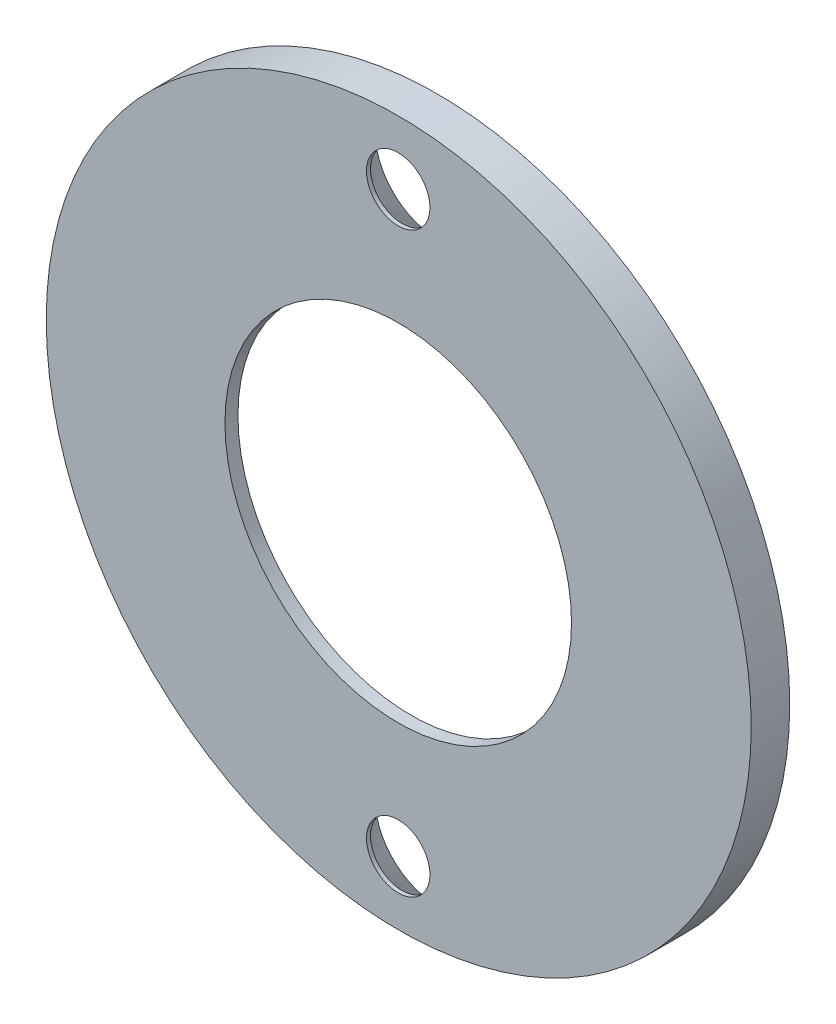
ISO-10303-21;
HEADER;
FILE_DESCRIPTION(('STEP AP214'),'2;1');
FILE_NAME('part.step','',(''),(''),'','','');
FILE_SCHEMA(('AUTOMOTIVE_DESIGN { 1 0 10303 214 1 1 1 1 }'));
ENDSEC;
DATA;
#1=APPLICATION_CONTEXT('core data for automotive mechanical design processes');
#2=APPLICATION_PROTOCOL_DEFINITION('international standard','automotive_design',2000,#1);
#3=PRODUCT_CONTEXT('',#1,'mechanical');
#4=PRODUCT('Part','Part','',(#3));
#5=PRODUCT_RELATED_PRODUCT_CATEGORY('part','',(#4));
#6=PRODUCT_DEFINITION_FORMATION('','',#4);
#7=PRODUCT_DEFINITION_CONTEXT('part definition',#1,'design');
#8=PRODUCT_DEFINITION('design','',#6,#7);
#9=PRODUCT_DEFINITION_SHAPE('','',#8);
#10=(LENGTH_UNIT() NAMED_UNIT(*) SI_UNIT(.MILLI.,.METRE.));
#11=(NAMED_UNIT(*) PLANE_ANGLE_UNIT() SI_UNIT($,.RADIAN.));
#12=(NAMED_UNIT(*) SI_UNIT($,.STERADIAN.) SOLID_ANGLE_UNIT());
#13=UNCERTAINTY_MEASURE_WITH_UNIT(LENGTH_MEASURE(1.E-05),#10,'distance_accuracy_value','');
#14=(GEOMETRIC_REPRESENTATION_CONTEXT(3) GLOBAL_UNCERTAINTY_ASSIGNED_CONTEXT((#13)) GLOBAL_UNIT_ASSIGNED_CONTEXT((#10,
#11,#12)) REPRESENTATION_CONTEXT('',''));
#15=CARTESIAN_POINT('',(0.,0.,0.));
#16=DIRECTION('',(0.,0.,1.));
#17=DIRECTION('',(1.,0.,0.));
#18=AXIS2_PLACEMENT_3D('',#15,#16,#17);
#19=CARTESIAN_POINT('',(0.,0.,-2.35438842952955));
#20=DIRECTION('',(0.,0.,-1.));
#21=DIRECTION('',(-1.,0.,0.));
#22=AXIS2_PLACEMENT_3D('',#19,#20,#21);
#23=PLANE('',#22);
#24=CARTESIAN_POINT('',(-0.0235782982945206,12.953978541894,-2.35438842952955));
#25=DIRECTION('',(0.,0.,-1.));
#26=DIRECTION('',(1.,0.,0.));
#27=AXIS2_PLACEMENT_3D('',#24,#25,#26);
#28=CIRCLE('',#27,1.4224);
#29=CARTESIAN_POINT('',(-1.44597829829452,12.953978541894,-2.35438842952955));
#30=VERTEX_POINT('',#29);
#31=EDGE_CURVE('E124',#30,#30,#28,.T.);
#32=ORIENTED_EDGE('',*,*,#31,.T.);
#33=EDGE_LOOP('',(#32));
#34=FACE_BOUND('',#33,.T.);
#35=CARTESIAN_POINT('',(-0.0235782982945324,-12.953978541894,-2.35438842952955));
#36=DIRECTION('',(0.,0.,-1.));
#37=DIRECTION('',(1.,0.,0.));
#38=AXIS2_PLACEMENT_3D('',#35,#36,#37);
#39=CIRCLE('',#38,1.4224);
#40=CARTESIAN_POINT('',(-1.44597829829453,-12.953978541894,-2.35438842952955));
#41=VERTEX_POINT('',#40);
#42=EDGE_CURVE('E116',#41,#41,#39,.T.);
#43=ORIENTED_EDGE('',*,*,#42,.T.);
#44=EDGE_LOOP('',(#43));
#45=FACE_BOUND('',#44,.T.);
#46=CARTESIAN_POINT('',(-0.0237208953445327,0.,-2.35438842952955));
#47=DIRECTION('',(0.,0.,-1.));
#48=DIRECTION('',(1.,0.,0.));
#49=AXIS2_PLACEMENT_3D('',#46,#47,#48);
#50=CIRCLE('',#49,7.7724);
#51=CARTESIAN_POINT('',(-7.79612089534453,0.,-2.35438842952955));
#52=VERTEX_POINT('',#51);
#53=EDGE_CURVE('E117',#52,#52,#50,.T.);
#54=ORIENTED_EDGE('',*,*,#53,.T.);
#55=EDGE_LOOP('',(#54));
#56=FACE_BOUND('',#55,.T.);
#57=CARTESIAN_POINT('',(0.,0.,-2.35438842952955));
#58=DIRECTION('',(0.,0.,1.));
#59=DIRECTION('',(1.,0.,0.));
#60=AXIS2_PLACEMENT_3D('',#57,#58,#59);
#61=CIRCLE('',#60,15.8098189243227);
#62=CARTESIAN_POINT('',(-15.8098189243227,0.,-2.35438842952955));
#63=VERTEX_POINT('',#62);
#64=EDGE_CURVE('E21',#63,#63,#61,.T.);
#65=ORIENTED_EDGE('',*,*,#64,.T.);
#66=EDGE_LOOP('',(#65));
#67=FACE_BOUND('',#66,.T.);
#68=ADVANCED_FACE('F17',(#34,#45,#56,#67),#23,.F.);
#69=CARTESIAN_POINT('',(0.,0.,-4.08158842952954));
#70=DIRECTION('',(0.,0.,1.));
#71=DIRECTION('',(1.,0.,0.));
#72=AXIS2_PLACEMENT_3D('',#69,#70,#71);
#73=CYLINDRICAL_SURFACE('',#72,15.8098189243227);
#74=ORIENTED_EDGE('',*,*,#64,.F.);
#75=DIRECTION('',(0.,0.,-1.));
#76=VECTOR('',#75,1.);
#77=CARTESIAN_POINT('',(-15.8098189243227,0.,-4.08158842952954));
#78=LINE('',#77,#76);
#79=CARTESIAN_POINT('',(-15.8098189243227,0.,-4.08158842952954));
#80=VERTEX_POINT('',#79);
#81=EDGE_CURVE('E11',#63,#80,#78,.T.);
#82=ORIENTED_EDGE('',*,*,#81,.T.);
#83=CARTESIAN_POINT('',(0.,0.,-4.08158842952954));
#84=DIRECTION('',(0.,0.,-1.));
#85=DIRECTION('',(1.,0.,0.));
#86=AXIS2_PLACEMENT_3D('',#83,#84,#85);
#87=CIRCLE('',#86,15.8098189243227);
#88=EDGE_CURVE('E95',#80,#80,#87,.T.);
#89=ORIENTED_EDGE('',*,*,#88,.F.);
#90=ORIENTED_EDGE('',*,*,#81,.F.);
#91=EDGE_LOOP('',(#74,#82,#89,#90));
#92=FACE_BOUND('',#91,.T.);
#93=ADVANCED_FACE('F147',(#92),#73,.T.);
#94=CARTESIAN_POINT('',(-0.0237208953445327,0.,-4.08158842952954));
#95=DIRECTION('',(0.,0.,1.));
#96=DIRECTION('',(1.,0.,0.));
#97=AXIS2_PLACEMENT_3D('',#94,#95,#96);
#98=CYLINDRICAL_SURFACE('',#97,7.7724);
#99=ORIENTED_EDGE('',*,*,#53,.F.);
#100=DIRECTION('',(0.,0.,-1.));
#101=VECTOR('',#100,1.);
#102=CARTESIAN_POINT('',(-7.79612089534453,0.,-4.08158842952954));
#103=LINE('',#102,#101);
#104=CARTESIAN_POINT('',(-7.79612089534453,0.,-2.93858842952955));
#105=VERTEX_POINT('',#104);
#106=EDGE_CURVE('E121',#52,#105,#103,.T.);
#107=ORIENTED_EDGE('',*,*,#106,.T.);
#108=CARTESIAN_POINT('',(-0.0237208953445327,0.,-2.93858842952955));
#109=DIRECTION('',(0.,0.,-1.));
#110=DIRECTION('',(1.,0.,0.));
#111=AXIS2_PLACEMENT_3D('',#108,#109,#110);
#112=CIRCLE('',#111,7.7724);
#113=EDGE_CURVE('E122',#105,#105,#112,.T.);
#114=ORIENTED_EDGE('',*,*,#113,.T.);
#115=ORIENTED_EDGE('',*,*,#106,.F.);
#116=EDGE_LOOP('',(#99,#107,#114,#115));
#117=FACE_BOUND('',#116,.T.);
#118=ADVANCED_FACE('F172',(#117),#98,.F.);
#119=CARTESIAN_POINT('',(0.,0.,-2.93858842952955));
#120=DIRECTION('',(0.,0.,-1.));
#121=DIRECTION('',(-1.,0.,0.));
#122=AXIS2_PLACEMENT_3D('',#119,#120,#121);
#123=PLANE('',#122);
#124=ORIENTED_EDGE('',*,*,#113,.F.);
#125=EDGE_LOOP('',(#124));
#126=FACE_BOUND('',#125,.T.);
#127=CARTESIAN_POINT('',(0.,0.,-2.93858842952955));
#128=DIRECTION('',(0.,0.,1.));
#129=DIRECTION('',(1.,0.,0.));
#130=AXIS2_PLACEMENT_3D('',#127,#128,#129);
#131=CIRCLE('',#130,10.16);
#132=CARTESIAN_POINT('',(-10.16,0.,-2.93858842952955));
#133=VERTEX_POINT('',#132);
#134=EDGE_CURVE('E109',#133,#133,#131,.T.);
#135=ORIENTED_EDGE('',*,*,#134,.F.);
#136=EDGE_LOOP('',(#135));
#137=FACE_BOUND('',#136,.T.);
#138=ADVANCED_FACE('F175',(#126,#137),#123,.T.);
#139=CARTESIAN_POINT('',(0.,0.,-4.08158842952954));
#140=DIRECTION('',(0.,0.,1.));
#141=DIRECTION('',(1.,0.,0.));
#142=AXIS2_PLACEMENT_3D('',#139,#140,#141);
#143=CYLINDRICAL_SURFACE('',#142,10.16);
#144=CARTESIAN_POINT('',(0.,0.,-4.08158842952954));
#145=DIRECTION('',(0.,0.,1.));
#146=DIRECTION('',(1.,0.,0.));
#147=AXIS2_PLACEMENT_3D('',#144,#145,#146);
#148=CIRCLE('',#147,10.16);
#149=CARTESIAN_POINT('',(-10.16,0.,-4.08158842952954));
#150=VERTEX_POINT('',#149);
#151=EDGE_CURVE('E112',#150,#150,#148,.T.);
#152=ORIENTED_EDGE('',*,*,#151,.F.);
#153=DIRECTION('',(0.,0.,1.));
#154=VECTOR('',#153,1.);
#155=CARTESIAN_POINT('',(-10.16,0.,-4.08158842952954));
#156=LINE('',#155,#154);
#157=EDGE_CURVE('E106',#150,#133,#156,.T.);
#158=ORIENTED_EDGE('',*,*,#157,.T.);
#159=ORIENTED_EDGE('',*,*,#134,.T.);
#160=ORIENTED_EDGE('',*,*,#157,.F.);
#161=EDGE_LOOP('',(#152,#158,#159,#160));
#162=FACE_BOUND('',#161,.T.);
#163=ADVANCED_FACE('F178',(#162),#143,.F.);
#164=CARTESIAN_POINT('',(-0.0235782982945206,12.953978541894,-4.08158842952954));
#165=DIRECTION('',(0.,0.,1.));
#166=DIRECTION('',(1.,0.,0.));
#167=AXIS2_PLACEMENT_3D('',#164,#165,#166);
#168=CYLINDRICAL_SURFACE('',#167,1.4224);
#169=ORIENTED_EDGE('',*,*,#31,.F.);
#170=DIRECTION('',(0.,0.,-1.));
#171=VECTOR('',#170,1.);
#172=CARTESIAN_POINT('',(-1.44597829829452,12.953978541894,-4.08158842952954));
#173=LINE('',#172,#171);
#174=CARTESIAN_POINT('',(-1.44597829829452,12.953978541894,-2.53296247972863));
#175=VERTEX_POINT('',#174);
#176=EDGE_CURVE('E110',#30,#175,#173,.T.);
#177=ORIENTED_EDGE('',*,*,#176,.T.);
#178=CARTESIAN_POINT('',(-0.0235782982945206,12.953978541894,-2.53296247972863));
#179=DIRECTION('',(0.,0.,1.));
#180=DIRECTION('',(1.,0.,0.));
#181=AXIS2_PLACEMENT_3D('',#178,#179,#180);
#182=CIRCLE('',#181,1.4224);
#183=EDGE_CURVE('E100',#175,#175,#182,.T.);
#184=ORIENTED_EDGE('',*,*,#183,.F.);
#185=ORIENTED_EDGE('',*,*,#176,.F.);
#186=EDGE_LOOP('',(#169,#177,#184,#185));
#187=FACE_BOUND('',#186,.T.);
#188=ADVANCED_FACE('F180',(#187),#168,.F.);
#189=CARTESIAN_POINT('',(-0.0235782982945207,12.953978541894,-3.3072754546291));
#190=DIRECTION('',(0.,0.,-1.));
#191=DIRECTION('',(1.,0.,0.));
#192=AXIS2_PLACEMENT_3D('',#189,#190,#191);
#193=CONICAL_SURFACE('',#192,2.0955,0.715584993317675);
#194=CARTESIAN_POINT('',(-0.0235782982945207,12.953978541894,-4.08158842952954));
#195=DIRECTION('',(0.,0.,-1.));
#196=DIRECTION('',(1.,0.,0.));
#197=AXIS2_PLACEMENT_3D('',#194,#195,#196);
#198=CIRCLE('',#197,2.7686);
#199=CARTESIAN_POINT('',(-2.79217829829451,12.953978541894,-4.08158842952954));
#200=VERTEX_POINT('',#199);
#201=EDGE_CURVE('E105',#200,#200,#198,.T.);
#202=ORIENTED_EDGE('',*,*,#201,.T.);
#203=DIRECTION('',(0.656059028990507,0.,0.754709580222772));
#204=VECTOR('',#203,1.);
#205=CARTESIAN_POINT('',(-2.11907829829452,12.953978541894,-3.3072754546291));
#206=LINE('',#205,#204);
#207=EDGE_CURVE('E198',#200,#175,#206,.T.);
#208=ORIENTED_EDGE('',*,*,#207,.T.);
#209=ORIENTED_EDGE('',*,*,#183,.T.);
#210=ORIENTED_EDGE('',*,*,#207,.F.);
#211=EDGE_LOOP('',(#202,#208,#209,#210));
#212=FACE_BOUND('',#211,.T.);
#213=ADVANCED_FACE('F160',(#212),#193,.F.);
#214=CARTESIAN_POINT('',(-0.0235782982945324,-12.953978541894,-4.08158842952954));
#215=DIRECTION('',(0.,0.,1.));
#216=DIRECTION('',(1.,0.,0.));
#217=AXIS2_PLACEMENT_3D('',#214,#215,#216);
#218=CYLINDRICAL_SURFACE('',#217,1.4224);
#219=ORIENTED_EDGE('',*,*,#42,.F.);
#220=DIRECTION('',(0.,0.,-1.));
#221=VECTOR('',#220,1.);
#222=CARTESIAN_POINT('',(-1.44597829829453,-12.953978541894,-4.08158842952954));
#223=LINE('',#222,#221);
#224=CARTESIAN_POINT('',(-1.44597829829453,-12.953978541894,-2.53296247972863));
#225=VERTEX_POINT('',#224);
#226=EDGE_CURVE('E132',#41,#225,#223,.T.);
#227=ORIENTED_EDGE('',*,*,#226,.T.);
#228=CARTESIAN_POINT('',(-0.0235782982945324,-12.953978541894,-2.53296247972863));
#229=DIRECTION('',(0.,0.,1.));
#230=DIRECTION('',(1.,0.,0.));
#231=AXIS2_PLACEMENT_3D('',#228,#229,#230);
#232=CIRCLE('',#231,1.4224);
#233=EDGE_CURVE('E87',#225,#225,#232,.T.);
#234=ORIENTED_EDGE('',*,*,#233,.F.);
#235=ORIENTED_EDGE('',*,*,#226,.F.);
#236=EDGE_LOOP('',(#219,#227,#234,#235));
#237=FACE_BOUND('',#236,.T.);
#238=ADVANCED_FACE('F151',(#237),#218,.F.);
#239=CARTESIAN_POINT('',(0.,0.,-4.08158842952954));
#240=DIRECTION('',(0.,0.,-1.));
#241=DIRECTION('',(-1.,0.,0.));
#242=AXIS2_PLACEMENT_3D('',#239,#240,#241);
#243=PLANE('',#242);
#244=CARTESIAN_POINT('',(-0.0235782982945325,-12.953978541894,-4.08158842952954));
#245=DIRECTION('',(0.,0.,-1.));
#246=DIRECTION('',(1.,0.,0.));
#247=AXIS2_PLACEMENT_3D('',#244,#245,#246);
#248=CIRCLE('',#247,2.7686);
#249=CARTESIAN_POINT('',(-2.79217829829454,-12.953978541894,-4.08158842952954));
#250=VERTEX_POINT('',#249);
#251=EDGE_CURVE('E85',#250,#250,#248,.T.);
#252=ORIENTED_EDGE('',*,*,#251,.F.);
#253=EDGE_LOOP('',(#252));
#254=FACE_BOUND('',#253,.T.);
#255=ORIENTED_EDGE('',*,*,#151,.T.);
#256=EDGE_LOOP('',(#255));
#257=FACE_BOUND('',#256,.T.);
#258=ORIENTED_EDGE('',*,*,#201,.F.);
#259=EDGE_LOOP('',(#258));
#260=FACE_BOUND('',#259,.T.);
#261=ORIENTED_EDGE('',*,*,#88,.T.);
#262=EDGE_LOOP('',(#261));
#263=FACE_BOUND('',#262,.T.);
#264=ADVANCED_FACE('F149',(#254,#257,#260,#263),#243,.T.);
#265=CARTESIAN_POINT('',(-0.0235782982945324,-12.953978541894,-3.3072754546291));
#266=DIRECTION('',(0.,0.,-1.));
#267=DIRECTION('',(1.,0.,0.));
#268=AXIS2_PLACEMENT_3D('',#265,#266,#267);
#269=CONICAL_SURFACE('',#268,2.0955,0.715584993317675);
#270=ORIENTED_EDGE('',*,*,#251,.T.);
#271=DIRECTION('',(0.656059028990507,0.,0.754709580222772));
#272=VECTOR('',#271,1.);
#273=CARTESIAN_POINT('',(-2.11907829829453,-12.953978541894,-3.3072754546291));
#274=LINE('',#273,#272);
#275=EDGE_CURVE('E83',#250,#225,#274,.T.);
#276=ORIENTED_EDGE('',*,*,#275,.T.);
#277=ORIENTED_EDGE('',*,*,#233,.T.);
#278=ORIENTED_EDGE('',*,*,#275,.F.);
#279=EDGE_LOOP('',(#270,#276,#277,#278));
#280=FACE_BOUND('',#279,.T.);
#281=ADVANCED_FACE('F19',(#280),#269,.F.);
#282=CLOSED_SHELL('',(#68,#93,#118,#138,#163,#188,#213,#238,#264,#281));
#283=MANIFOLD_SOLID_BREP('B1',#282);
#284=ADVANCED_BREP_SHAPE_REPRESENTATION('',(#18,#283),#14);
#285=SHAPE_DEFINITION_REPRESENTATION(#9,#284);
ENDSEC;
END-ISO-10303-21;
